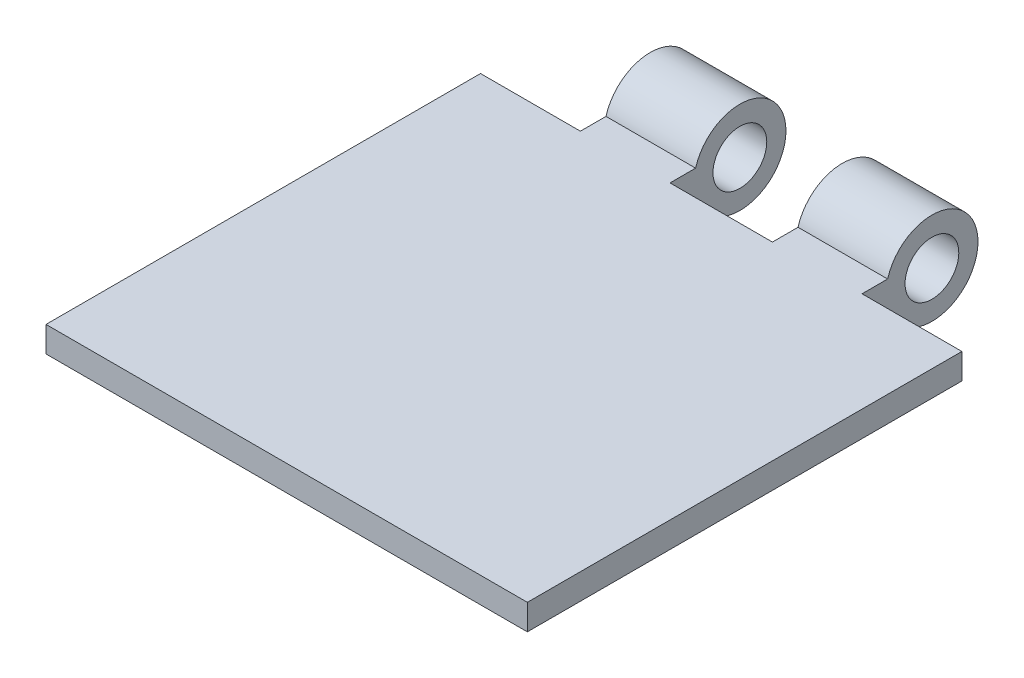
ISO-10303-21;
HEADER;
FILE_DESCRIPTION(('STEP AP214'),'2;1');
FILE_NAME('part.step','',(''),(''),'','','');
FILE_SCHEMA(('AUTOMOTIVE_DESIGN { 1 0 10303 214 1 1 1 1 }'));
ENDSEC;
DATA;
#1=APPLICATION_CONTEXT('core data for automotive mechanical design processes');
#2=APPLICATION_PROTOCOL_DEFINITION('international standard','automotive_design',2000,#1);
#3=PRODUCT_CONTEXT('',#1,'mechanical');
#4=PRODUCT('Part','Part','',(#3));
#5=PRODUCT_RELATED_PRODUCT_CATEGORY('part','',(#4));
#6=PRODUCT_DEFINITION_FORMATION('','',#4);
#7=PRODUCT_DEFINITION_CONTEXT('part definition',#1,'design');
#8=PRODUCT_DEFINITION('design','',#6,#7);
#9=PRODUCT_DEFINITION_SHAPE('','',#8);
#10=(LENGTH_UNIT() NAMED_UNIT(*) SI_UNIT(.MILLI.,.METRE.));
#11=(NAMED_UNIT(*) PLANE_ANGLE_UNIT() SI_UNIT($,.RADIAN.));
#12=(NAMED_UNIT(*) SI_UNIT($,.STERADIAN.) SOLID_ANGLE_UNIT());
#13=UNCERTAINTY_MEASURE_WITH_UNIT(LENGTH_MEASURE(1.E-05),#10,'distance_accuracy_value','');
#14=(GEOMETRIC_REPRESENTATION_CONTEXT(3) GLOBAL_UNCERTAINTY_ASSIGNED_CONTEXT((#13)) GLOBAL_UNIT_ASSIGNED_CONTEXT((#10,
#11,#12)) REPRESENTATION_CONTEXT('',''));
#15=CARTESIAN_POINT('',(0.,0.,0.));
#16=DIRECTION('',(0.,0.,1.));
#17=DIRECTION('',(1.,0.,0.));
#18=AXIS2_PLACEMENT_3D('',#15,#16,#17);
#19=CARTESIAN_POINT('',(-23.876,2.54,-20.32));
#20=DIRECTION('',(1.,0.,0.));
#21=DIRECTION('',(0.,0.,-1.));
#22=AXIS2_PLACEMENT_3D('',#19,#20,#21);
#23=PLANE('',#22);
#24=DIRECTION('',(0.,1.,0.));
#25=VECTOR('',#24,1.);
#26=CARTESIAN_POINT('',(-23.876,2.54,-17.7059294176892));
#27=LINE('',#26,#25);
#28=CARTESIAN_POINT('',(-23.876,0.,-17.7059294176892));
#29=VERTEX_POINT('',#28);
#30=CARTESIAN_POINT('',(-23.876,2.54,-17.7059294176892));
#31=VERTEX_POINT('',#30);
#32=EDGE_CURVE('E128',#29,#31,#27,.T.);
#33=ORIENTED_EDGE('',*,*,#32,.F.);
#34=DIRECTION('',(0.,0.,1.));
#35=VECTOR('',#34,1.);
#36=CARTESIAN_POINT('',(-23.876,0.,-20.32));
#37=LINE('',#36,#35);
#38=CARTESIAN_POINT('',(-23.876,0.,25.4));
#39=VERTEX_POINT('',#38);
#40=EDGE_CURVE('E123',#29,#39,#37,.T.);
#41=ORIENTED_EDGE('',*,*,#40,.T.);
#42=DIRECTION('',(0.,-1.,0.));
#43=VECTOR('',#42,1.);
#44=CARTESIAN_POINT('',(-23.876,2.54,25.4));
#45=LINE('',#44,#43);
#46=CARTESIAN_POINT('',(-23.876,2.54,25.4));
#47=VERTEX_POINT('',#46);
#48=EDGE_CURVE('E127',#47,#39,#45,.T.);
#49=ORIENTED_EDGE('',*,*,#48,.F.);
#50=DIRECTION('',(0.,0.,1.));
#51=VECTOR('',#50,1.);
#52=CARTESIAN_POINT('',(-23.876,2.54,-20.32));
#53=LINE('',#52,#51);
#54=EDGE_CURVE('E199',#31,#47,#53,.T.);
#55=ORIENTED_EDGE('',*,*,#54,.F.);
#56=EDGE_LOOP('',(#33,#41,#49,#55));
#57=FACE_BOUND('',#56,.T.);
#58=ADVANCED_FACE('F33',(#57),#23,.F.);
#59=CARTESIAN_POINT('',(23.876,1.27,-24.638));
#60=DIRECTION('',(-1.,0.,0.));
#61=DIRECTION('',(0.,0.,1.));
#62=AXIS2_PLACEMENT_3D('',#59,#60,#61);
#63=CYLINDRICAL_SURFACE('',#62,4.572);
#64=DIRECTION('',(-1.,0.,0.));
#65=VECTOR('',#64,1.);
#66=CARTESIAN_POINT('',(23.876,0.,-20.2459294176892));
#67=LINE('',#66,#65);
#68=CARTESIAN_POINT('',(-5.08,0.,-20.2459294176892));
#69=VERTEX_POINT('',#68);
#70=CARTESIAN_POINT('',(-13.97,0.,-20.2459294176892));
#71=VERTEX_POINT('',#70);
#72=EDGE_CURVE('E203',#69,#71,#67,.T.);
#73=ORIENTED_EDGE('',*,*,#72,.T.);
#74=CARTESIAN_POINT('',(-13.97,1.27,-24.638));
#75=DIRECTION('',(1.,0.,0.));
#76=DIRECTION('',(0.,1.,0.));
#77=AXIS2_PLACEMENT_3D('',#74,#75,#76);
#78=CIRCLE('',#77,4.572);
#79=CARTESIAN_POINT('',(-13.97,2.54,-20.2459294176892));
#80=VERTEX_POINT('',#79);
#81=EDGE_CURVE('E173',#71,#80,#78,.T.);
#82=ORIENTED_EDGE('',*,*,#81,.T.);
#83=DIRECTION('',(-1.,0.,0.));
#84=VECTOR('',#83,1.);
#85=CARTESIAN_POINT('',(23.876,2.54,-20.2459294176892));
#86=LINE('',#85,#84);
#87=CARTESIAN_POINT('',(-5.08,2.54,-20.2459294176892));
#88=VERTEX_POINT('',#87);
#89=EDGE_CURVE('E197',#88,#80,#86,.T.);
#90=ORIENTED_EDGE('',*,*,#89,.F.);
#91=CARTESIAN_POINT('',(-5.08,1.27,-24.638));
#92=DIRECTION('',(-1.,0.,0.));
#93=DIRECTION('',(0.,-1.,0.));
#94=AXIS2_PLACEMENT_3D('',#91,#92,#93);
#95=CIRCLE('',#94,4.572);
#96=EDGE_CURVE('E211',#88,#69,#95,.T.);
#97=ORIENTED_EDGE('',*,*,#96,.T.);
#98=EDGE_LOOP('',(#73,#82,#90,#97));
#99=FACE_BOUND('',#98,.T.);
#100=ADVANCED_FACE('F252',(#99),#63,.T.);
#101=CARTESIAN_POINT('',(0.,2.54,0.));
#102=DIRECTION('',(0.,1.,0.));
#103=DIRECTION('',(0.,0.,1.));
#104=AXIS2_PLACEMENT_3D('',#101,#102,#103);
#105=PLANE('',#104);
#106=DIRECTION('',(0.,0.,1.));
#107=VECTOR('',#106,1.);
#108=CARTESIAN_POINT('',(13.97,2.54,0.));
#109=LINE('',#108,#107);
#110=CARTESIAN_POINT('',(13.97,2.54,-20.2459294176892));
#111=VERTEX_POINT('',#110);
#112=CARTESIAN_POINT('',(13.97,2.54,-17.7059294176892));
#113=VERTEX_POINT('',#112);
#114=EDGE_CURVE('E161',#111,#113,#109,.T.);
#115=ORIENTED_EDGE('',*,*,#114,.F.);
#116=CARTESIAN_POINT('',(5.08,2.54,-20.2459294176892));
#117=VERTEX_POINT('',#116);
#118=EDGE_CURVE('E131',#111,#117,#86,.T.);
#119=ORIENTED_EDGE('',*,*,#118,.T.);
#120=DIRECTION('',(0.,0.,-1.));
#121=VECTOR('',#120,1.);
#122=CARTESIAN_POINT('',(5.08,2.54,0.));
#123=LINE('',#122,#121);
#124=CARTESIAN_POINT('',(5.08,2.54,-17.7059294176892));
#125=VERTEX_POINT('',#124);
#126=EDGE_CURVE('E187',#125,#117,#123,.T.);
#127=ORIENTED_EDGE('',*,*,#126,.F.);
#128=DIRECTION('',(1.,0.,0.));
#129=VECTOR('',#128,1.);
#130=CARTESIAN_POINT('',(0.,2.54,-17.7059294176892));
#131=LINE('',#130,#129);
#132=CARTESIAN_POINT('',(-5.08,2.54,-17.7059294176892));
#133=VERTEX_POINT('',#132);
#134=EDGE_CURVE('E195',#133,#125,#131,.T.);
#135=ORIENTED_EDGE('',*,*,#134,.F.);
#136=DIRECTION('',(0.,0.,1.));
#137=VECTOR('',#136,1.);
#138=CARTESIAN_POINT('',(-5.08,2.54,0.));
#139=LINE('',#138,#137);
#140=EDGE_CURVE('E193',#88,#133,#139,.T.);
#141=ORIENTED_EDGE('',*,*,#140,.F.);
#142=ORIENTED_EDGE('',*,*,#89,.T.);
#143=DIRECTION('',(0.,0.,-1.));
#144=VECTOR('',#143,1.);
#145=CARTESIAN_POINT('',(-13.97,2.54,0.));
#146=LINE('',#145,#144);
#147=CARTESIAN_POINT('',(-13.97,2.54,-17.7059294176892));
#148=VERTEX_POINT('',#147);
#149=EDGE_CURVE('E176',#148,#80,#146,.T.);
#150=ORIENTED_EDGE('',*,*,#149,.F.);
#151=DIRECTION('',(-1.,0.,0.));
#152=VECTOR('',#151,1.);
#153=CARTESIAN_POINT('',(0.,2.54,-17.7059294176892));
#154=LINE('',#153,#152);
#155=EDGE_CURVE('E170',#148,#31,#154,.T.);
#156=ORIENTED_EDGE('',*,*,#155,.T.);
#157=ORIENTED_EDGE('',*,*,#54,.T.);
#158=DIRECTION('',(-1.,0.,0.));
#159=VECTOR('',#158,1.);
#160=CARTESIAN_POINT('',(-23.876,2.54,25.4));
#161=LINE('',#160,#159);
#162=CARTESIAN_POINT('',(23.876,2.54,25.4));
#163=VERTEX_POINT('',#162);
#164=EDGE_CURVE('E147',#163,#47,#161,.T.);
#165=ORIENTED_EDGE('',*,*,#164,.F.);
#166=DIRECTION('',(0.,0.,-1.));
#167=VECTOR('',#166,1.);
#168=CARTESIAN_POINT('',(23.876,2.54,-20.32));
#169=LINE('',#168,#167);
#170=CARTESIAN_POINT('',(23.876,2.54,-17.7059294176892));
#171=VERTEX_POINT('',#170);
#172=EDGE_CURVE('E201',#163,#171,#169,.T.);
#173=ORIENTED_EDGE('',*,*,#172,.T.);
#174=DIRECTION('',(1.,0.,0.));
#175=VECTOR('',#174,1.);
#176=CARTESIAN_POINT('',(0.,2.54,-17.7059294176892));
#177=LINE('',#176,#175);
#178=EDGE_CURVE('E165',#113,#171,#177,.T.);
#179=ORIENTED_EDGE('',*,*,#178,.F.);
#180=EDGE_LOOP('',(#115,#119,#127,#135,#141,#142,#150,#156,#157,#165,#173,#179));
#181=FACE_BOUND('',#180,.T.);
#182=ADVANCED_FACE('F235',(#181),#105,.T.);
#183=CARTESIAN_POINT('',(0.,0.,0.));
#184=DIRECTION('',(0.,1.,0.));
#185=DIRECTION('',(0.,0.,1.));
#186=AXIS2_PLACEMENT_3D('',#183,#184,#185);
#187=PLANE('',#186);
#188=CARTESIAN_POINT('',(13.97,0.,-20.2459294176892));
#189=VERTEX_POINT('',#188);
#190=CARTESIAN_POINT('',(5.08,0.,-20.2459294176892));
#191=VERTEX_POINT('',#190);
#192=EDGE_CURVE('E206',#189,#191,#67,.T.);
#193=ORIENTED_EDGE('',*,*,#192,.F.);
#194=DIRECTION('',(0.,0.,1.));
#195=VECTOR('',#194,1.);
#196=CARTESIAN_POINT('',(13.97,0.,0.));
#197=LINE('',#196,#195);
#198=CARTESIAN_POINT('',(13.97,0.,-17.7059294176892));
#199=VERTEX_POINT('',#198);
#200=EDGE_CURVE('E47',#189,#199,#197,.T.);
#201=ORIENTED_EDGE('',*,*,#200,.T.);
#202=DIRECTION('',(1.,0.,0.));
#203=VECTOR('',#202,1.);
#204=CARTESIAN_POINT('',(0.,0.,-17.7059294176892));
#205=LINE('',#204,#203);
#206=CARTESIAN_POINT('',(23.876,0.,-17.7059294176892));
#207=VERTEX_POINT('',#206);
#208=EDGE_CURVE('E163',#199,#207,#205,.T.);
#209=ORIENTED_EDGE('',*,*,#208,.T.);
#210=DIRECTION('',(0.,0.,-1.));
#211=VECTOR('',#210,1.);
#212=CARTESIAN_POINT('',(23.876,0.,-20.32));
#213=LINE('',#212,#211);
#214=CARTESIAN_POINT('',(23.876,0.,25.4));
#215=VERTEX_POINT('',#214);
#216=EDGE_CURVE('E130',#215,#207,#213,.T.);
#217=ORIENTED_EDGE('',*,*,#216,.F.);
#218=DIRECTION('',(1.,0.,0.));
#219=VECTOR('',#218,1.);
#220=CARTESIAN_POINT('',(-23.876,0.,25.4));
#221=LINE('',#220,#219);
#222=EDGE_CURVE('E134',#39,#215,#221,.T.);
#223=ORIENTED_EDGE('',*,*,#222,.F.);
#224=ORIENTED_EDGE('',*,*,#40,.F.);
#225=DIRECTION('',(-1.,0.,0.));
#226=VECTOR('',#225,1.);
#227=CARTESIAN_POINT('',(0.,0.,-17.7059294176892));
#228=LINE('',#227,#226);
#229=CARTESIAN_POINT('',(-13.97,0.,-17.7059294176892));
#230=VERTEX_POINT('',#229);
#231=EDGE_CURVE('E55',#230,#29,#228,.T.);
#232=ORIENTED_EDGE('',*,*,#231,.F.);
#233=DIRECTION('',(0.,0.,-1.));
#234=VECTOR('',#233,1.);
#235=CARTESIAN_POINT('',(-13.97,0.,0.));
#236=LINE('',#235,#234);
#237=EDGE_CURVE('E218',#230,#71,#236,.T.);
#238=ORIENTED_EDGE('',*,*,#237,.T.);
#239=ORIENTED_EDGE('',*,*,#72,.F.);
#240=DIRECTION('',(0.,0.,1.));
#241=VECTOR('',#240,1.);
#242=CARTESIAN_POINT('',(-5.08,0.,0.));
#243=LINE('',#242,#241);
#244=CARTESIAN_POINT('',(-5.08,0.,-17.7059294176892));
#245=VERTEX_POINT('',#244);
#246=EDGE_CURVE('E190',#69,#245,#243,.T.);
#247=ORIENTED_EDGE('',*,*,#246,.T.);
#248=DIRECTION('',(1.,0.,0.));
#249=VECTOR('',#248,1.);
#250=CARTESIAN_POINT('',(0.,0.,-17.7059294176892));
#251=LINE('',#250,#249);
#252=CARTESIAN_POINT('',(5.08,0.,-17.7059294176892));
#253=VERTEX_POINT('',#252);
#254=EDGE_CURVE('E214',#245,#253,#251,.T.);
#255=ORIENTED_EDGE('',*,*,#254,.T.);
#256=DIRECTION('',(0.,0.,-1.));
#257=VECTOR('',#256,1.);
#258=CARTESIAN_POINT('',(5.08,0.,0.));
#259=LINE('',#258,#257);
#260=EDGE_CURVE('E184',#253,#191,#259,.T.);
#261=ORIENTED_EDGE('',*,*,#260,.T.);
#262=EDGE_LOOP('',(#193,#201,#209,#217,#223,#224,#232,#238,#239,#247,#255,#261));
#263=FACE_BOUND('',#262,.T.);
#264=ADVANCED_FACE('F136',(#263),#187,.F.);
#265=CARTESIAN_POINT('',(23.876,2.54,-20.32));
#266=DIRECTION('',(-1.,0.,0.));
#267=DIRECTION('',(0.,0.,1.));
#268=AXIS2_PLACEMENT_3D('',#265,#266,#267);
#269=PLANE('',#268);
#270=ORIENTED_EDGE('',*,*,#216,.T.);
#271=DIRECTION('',(0.,1.,0.));
#272=VECTOR('',#271,1.);
#273=CARTESIAN_POINT('',(23.876,2.54,-17.7059294176892));
#274=LINE('',#273,#272);
#275=EDGE_CURVE('E11',#207,#171,#274,.T.);
#276=ORIENTED_EDGE('',*,*,#275,.T.);
#277=ORIENTED_EDGE('',*,*,#172,.F.);
#278=DIRECTION('',(0.,1.,0.));
#279=VECTOR('',#278,1.);
#280=CARTESIAN_POINT('',(23.876,2.54,25.4));
#281=LINE('',#280,#279);
#282=EDGE_CURVE('E142',#215,#163,#281,.T.);
#283=ORIENTED_EDGE('',*,*,#282,.F.);
#284=EDGE_LOOP('',(#270,#276,#277,#283));
#285=FACE_BOUND('',#284,.T.);
#286=ADVANCED_FACE('F243',(#285),#269,.F.);
#287=ORIENTED_EDGE('',*,*,#118,.F.);
#288=CARTESIAN_POINT('',(13.97,1.27,-24.638));
#289=DIRECTION('',(-1.,0.,0.));
#290=DIRECTION('',(0.,-1.,0.));
#291=AXIS2_PLACEMENT_3D('',#288,#289,#290);
#292=CIRCLE('',#291,4.572);
#293=EDGE_CURVE('E40',#111,#189,#292,.T.);
#294=ORIENTED_EDGE('',*,*,#293,.T.);
#295=ORIENTED_EDGE('',*,*,#192,.T.);
#296=CARTESIAN_POINT('',(5.08,1.27,-24.638));
#297=DIRECTION('',(1.,0.,0.));
#298=DIRECTION('',(0.,1.,0.));
#299=AXIS2_PLACEMENT_3D('',#296,#297,#298);
#300=CIRCLE('',#299,4.572);
#301=EDGE_CURVE('E208',#191,#117,#300,.T.);
#302=ORIENTED_EDGE('',*,*,#301,.T.);
#303=EDGE_LOOP('',(#287,#294,#295,#302));
#304=FACE_BOUND('',#303,.T.);
#305=ADVANCED_FACE('F222',(#304),#63,.T.);
#306=CARTESIAN_POINT('',(0.,0.,-17.7059294176892));
#307=DIRECTION('',(0.,0.,1.));
#308=DIRECTION('',(1.,0.,0.));
#309=AXIS2_PLACEMENT_3D('',#306,#307,#308);
#310=PLANE('',#309);
#311=ORIENTED_EDGE('',*,*,#134,.T.);
#312=DIRECTION('',(0.,-1.,0.));
#313=VECTOR('',#312,1.);
#314=CARTESIAN_POINT('',(5.08,7.32465902130974,-17.7059294176892));
#315=LINE('',#314,#313);
#316=EDGE_CURVE('E181',#125,#253,#315,.T.);
#317=ORIENTED_EDGE('',*,*,#316,.T.);
#318=ORIENTED_EDGE('',*,*,#254,.F.);
#319=DIRECTION('',(0.,1.,0.));
#320=VECTOR('',#319,1.);
#321=CARTESIAN_POINT('',(-5.08,7.32465902130974,-17.7059294176892));
#322=LINE('',#321,#320);
#323=EDGE_CURVE('E178',#245,#133,#322,.T.);
#324=ORIENTED_EDGE('',*,*,#323,.T.);
#325=EDGE_LOOP('',(#311,#317,#318,#324));
#326=FACE_BOUND('',#325,.T.);
#327=ADVANCED_FACE('F230',(#326),#310,.F.);
#328=CARTESIAN_POINT('',(-5.08,7.32465902130974,-17.7059294176892));
#329=DIRECTION('',(-1.,0.,0.));
#330=DIRECTION('',(0.,-1.,0.));
#331=AXIS2_PLACEMENT_3D('',#328,#329,#330);
#332=PLANE('',#331);
#333=CARTESIAN_POINT('',(-5.08,1.27,-24.638));
#334=DIRECTION('',(-1.,0.,0.));
#335=DIRECTION('',(0.,-1.,0.));
#336=AXIS2_PLACEMENT_3D('',#333,#334,#335);
#337=CIRCLE('',#336,2.667);
#338=CARTESIAN_POINT('',(-5.08,-1.397,-24.638));
#339=VERTEX_POINT('',#338);
#340=EDGE_CURVE('E148',#339,#339,#337,.T.);
#341=ORIENTED_EDGE('',*,*,#340,.T.);
#342=EDGE_LOOP('',(#341));
#343=FACE_BOUND('',#342,.T.);
#344=ORIENTED_EDGE('',*,*,#140,.T.);
#345=ORIENTED_EDGE('',*,*,#323,.F.);
#346=ORIENTED_EDGE('',*,*,#246,.F.);
#347=ORIENTED_EDGE('',*,*,#96,.F.);
#348=EDGE_LOOP('',(#344,#345,#346,#347));
#349=FACE_BOUND('',#348,.T.);
#350=ADVANCED_FACE('F254',(#343,#349),#332,.F.);
#351=CARTESIAN_POINT('',(5.08,7.32465902130974,-17.7059294176892));
#352=DIRECTION('',(1.,0.,0.));
#353=DIRECTION('',(0.,1.,0.));
#354=AXIS2_PLACEMENT_3D('',#351,#352,#353);
#355=PLANE('',#354);
#356=CARTESIAN_POINT('',(5.08,1.27,-24.638));
#357=DIRECTION('',(1.,0.,0.));
#358=DIRECTION('',(0.,1.,0.));
#359=AXIS2_PLACEMENT_3D('',#356,#357,#358);
#360=CIRCLE('',#359,2.667);
#361=CARTESIAN_POINT('',(5.08,3.937,-24.638));
#362=VERTEX_POINT('',#361);
#363=EDGE_CURVE('E151',#362,#362,#360,.T.);
#364=ORIENTED_EDGE('',*,*,#363,.T.);
#365=EDGE_LOOP('',(#364));
#366=FACE_BOUND('',#365,.T.);
#367=ORIENTED_EDGE('',*,*,#126,.T.);
#368=ORIENTED_EDGE('',*,*,#301,.F.);
#369=ORIENTED_EDGE('',*,*,#260,.F.);
#370=ORIENTED_EDGE('',*,*,#316,.F.);
#371=EDGE_LOOP('',(#367,#368,#369,#370));
#372=FACE_BOUND('',#371,.T.);
#373=ADVANCED_FACE('F227',(#366,#372),#355,.F.);
#374=CARTESIAN_POINT('',(-13.97,6.94694064636466,-17.7059294176892));
#375=DIRECTION('',(1.,0.,0.));
#376=DIRECTION('',(0.,1.,0.));
#377=AXIS2_PLACEMENT_3D('',#374,#375,#376);
#378=PLANE('',#377);
#379=CARTESIAN_POINT('',(-13.97,1.27,-24.638));
#380=DIRECTION('',(1.,0.,0.));
#381=DIRECTION('',(0.,1.,0.));
#382=AXIS2_PLACEMENT_3D('',#379,#380,#381);
#383=CIRCLE('',#382,2.667);
#384=CARTESIAN_POINT('',(-13.97,3.937,-24.638));
#385=VERTEX_POINT('',#384);
#386=EDGE_CURVE('E392',#385,#385,#383,.T.);
#387=ORIENTED_EDGE('',*,*,#386,.T.);
#388=EDGE_LOOP('',(#387));
#389=FACE_BOUND('',#388,.T.);
#390=ORIENTED_EDGE('',*,*,#149,.T.);
#391=ORIENTED_EDGE('',*,*,#81,.F.);
#392=ORIENTED_EDGE('',*,*,#237,.F.);
#393=DIRECTION('',(0.,-1.,0.));
#394=VECTOR('',#393,1.);
#395=CARTESIAN_POINT('',(-13.97,6.94694064636466,-17.7059294176892));
#396=LINE('',#395,#394);
#397=EDGE_CURVE('E167',#148,#230,#396,.T.);
#398=ORIENTED_EDGE('',*,*,#397,.F.);
#399=EDGE_LOOP('',(#390,#391,#392,#398));
#400=FACE_BOUND('',#399,.T.);
#401=ADVANCED_FACE('F248',(#389,#400),#378,.F.);
#402=CARTESIAN_POINT('',(0.,0.,-17.7059294176892));
#403=DIRECTION('',(0.,0.,-1.));
#404=DIRECTION('',(-1.,0.,0.));
#405=AXIS2_PLACEMENT_3D('',#402,#403,#404);
#406=PLANE('',#405);
#407=ORIENTED_EDGE('',*,*,#397,.T.);
#408=ORIENTED_EDGE('',*,*,#231,.T.);
#409=ORIENTED_EDGE('',*,*,#32,.T.);
#410=ORIENTED_EDGE('',*,*,#155,.F.);
#411=EDGE_LOOP('',(#407,#408,#409,#410));
#412=FACE_BOUND('',#411,.T.);
#413=ADVANCED_FACE('F246',(#412),#406,.T.);
#414=CARTESIAN_POINT('',(13.97,7.32465902130973,-17.7059294176892));
#415=DIRECTION('',(-1.,0.,0.));
#416=DIRECTION('',(0.,-1.,0.));
#417=AXIS2_PLACEMENT_3D('',#414,#415,#416);
#418=PLANE('',#417);
#419=CARTESIAN_POINT('',(13.97,1.27,-24.638));
#420=DIRECTION('',(1.,0.,0.));
#421=DIRECTION('',(0.,1.,0.));
#422=AXIS2_PLACEMENT_3D('',#419,#420,#421);
#423=CIRCLE('',#422,2.667);
#424=CARTESIAN_POINT('',(13.97,3.937,-24.638));
#425=VERTEX_POINT('',#424);
#426=EDGE_CURVE('E393',#425,#425,#423,.T.);
#427=ORIENTED_EDGE('',*,*,#426,.F.);
#428=EDGE_LOOP('',(#427));
#429=FACE_BOUND('',#428,.T.);
#430=ORIENTED_EDGE('',*,*,#114,.T.);
#431=DIRECTION('',(0.,1.,0.));
#432=VECTOR('',#431,1.);
#433=CARTESIAN_POINT('',(13.97,7.32465902130973,-17.7059294176892));
#434=LINE('',#433,#432);
#435=EDGE_CURVE('E157',#199,#113,#434,.T.);
#436=ORIENTED_EDGE('',*,*,#435,.F.);
#437=ORIENTED_EDGE('',*,*,#200,.F.);
#438=ORIENTED_EDGE('',*,*,#293,.F.);
#439=EDGE_LOOP('',(#430,#436,#437,#438));
#440=FACE_BOUND('',#439,.T.);
#441=ADVANCED_FACE('F239',(#429,#440),#418,.F.);
#442=CARTESIAN_POINT('',(0.,0.,-17.7059294176892));
#443=DIRECTION('',(0.,0.,1.));
#444=DIRECTION('',(1.,0.,0.));
#445=AXIS2_PLACEMENT_3D('',#442,#443,#444);
#446=PLANE('',#445);
#447=ORIENTED_EDGE('',*,*,#178,.T.);
#448=ORIENTED_EDGE('',*,*,#275,.F.);
#449=ORIENTED_EDGE('',*,*,#208,.F.);
#450=ORIENTED_EDGE('',*,*,#435,.T.);
#451=EDGE_LOOP('',(#447,#448,#449,#450));
#452=FACE_BOUND('',#451,.T.);
#453=ADVANCED_FACE('F241',(#452),#446,.F.);
#454=CARTESIAN_POINT('',(0.,0.,25.4));
#455=DIRECTION('',(0.,0.,1.));
#456=DIRECTION('',(1.,0.,0.));
#457=AXIS2_PLACEMENT_3D('',#454,#455,#456);
#458=PLANE('',#457);
#459=ORIENTED_EDGE('',*,*,#48,.T.);
#460=ORIENTED_EDGE('',*,*,#222,.T.);
#461=ORIENTED_EDGE('',*,*,#282,.T.);
#462=ORIENTED_EDGE('',*,*,#164,.T.);
#463=EDGE_LOOP('',(#459,#460,#461,#462));
#464=FACE_BOUND('',#463,.T.);
#465=ADVANCED_FACE('F145',(#464),#458,.T.);
#466=CARTESIAN_POINT('',(-19.812,1.27,-24.638));
#467=DIRECTION('',(1.,0.,0.));
#468=DIRECTION('',(0.,1.,0.));
#469=AXIS2_PLACEMENT_3D('',#466,#467,#468);
#470=CYLINDRICAL_SURFACE('',#469,2.667);
#471=ORIENTED_EDGE('',*,*,#426,.T.);
#472=EDGE_LOOP('',(#471));
#473=FACE_BOUND('',#472,.T.);
#474=ORIENTED_EDGE('',*,*,#363,.F.);
#475=EDGE_LOOP('',(#474));
#476=FACE_BOUND('',#475,.T.);
#477=ADVANCED_FACE('F361',(#473,#476),#470,.F.);
#478=ORIENTED_EDGE('',*,*,#386,.F.);
#479=EDGE_LOOP('',(#478));
#480=FACE_BOUND('',#479,.T.);
#481=ORIENTED_EDGE('',*,*,#340,.F.);
#482=EDGE_LOOP('',(#481));
#483=FACE_BOUND('',#482,.T.);
#484=ADVANCED_FACE('F369',(#480,#483),#470,.F.);
#485=CLOSED_SHELL('',(#58,#100,#182,#264,#286,#305,#327,#350,#373,#401,#413,#441,#453,#465,#477,#484));
#486=MANIFOLD_SOLID_BREP('B2',#485);
#487=ADVANCED_BREP_SHAPE_REPRESENTATION('',(#18,#486),#14);
#488=SHAPE_DEFINITION_REPRESENTATION(#9,#487);
ENDSEC;
END-ISO-10303-21;
